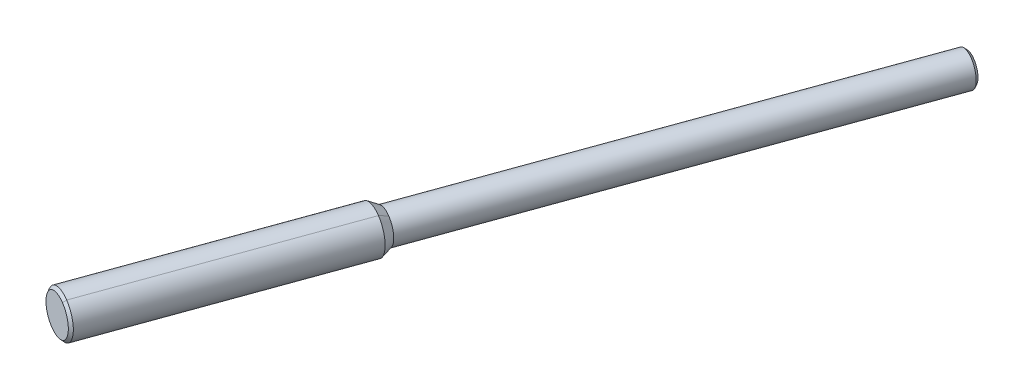
ISO-10303-21;
HEADER;
FILE_DESCRIPTION(('STEP AP214'),'2;1');
FILE_NAME('part.step','',(''),(''),'','','');
FILE_SCHEMA(('AUTOMOTIVE_DESIGN { 1 0 10303 214 1 1 1 1 }'));
ENDSEC;
DATA;
#1=APPLICATION_CONTEXT('core data for automotive mechanical design processes');
#2=APPLICATION_PROTOCOL_DEFINITION('international standard','automotive_design',2000,#1);
#3=PRODUCT_CONTEXT('',#1,'mechanical');
#4=PRODUCT('Part','Part','',(#3));
#5=PRODUCT_RELATED_PRODUCT_CATEGORY('part','',(#4));
#6=PRODUCT_DEFINITION_FORMATION('','',#4);
#7=PRODUCT_DEFINITION_CONTEXT('part definition',#1,'design');
#8=PRODUCT_DEFINITION('design','',#6,#7);
#9=PRODUCT_DEFINITION_SHAPE('','',#8);
#10=(LENGTH_UNIT() NAMED_UNIT(*) SI_UNIT(.MILLI.,.METRE.));
#11=(NAMED_UNIT(*) PLANE_ANGLE_UNIT() SI_UNIT($,.RADIAN.));
#12=(NAMED_UNIT(*) SI_UNIT($,.STERADIAN.) SOLID_ANGLE_UNIT());
#13=UNCERTAINTY_MEASURE_WITH_UNIT(LENGTH_MEASURE(1.E-05),#10,'distance_accuracy_value','');
#14=(GEOMETRIC_REPRESENTATION_CONTEXT(3) GLOBAL_UNCERTAINTY_ASSIGNED_CONTEXT((#13)) GLOBAL_UNIT_ASSIGNED_CONTEXT((#10,
#11,#12)) REPRESENTATION_CONTEXT('',''));
#15=CARTESIAN_POINT('',(0.,0.,0.));
#16=DIRECTION('',(0.,0.,1.));
#17=DIRECTION('',(1.,0.,0.));
#18=AXIS2_PLACEMENT_3D('',#15,#16,#17);
#19=CARTESIAN_POINT('',(235.856247632616,96.4726494375247,-182.327791961104));
#20=DIRECTION('',(0.340654989152249,0.000648546411340683,-0.940188150187628));
#21=DIRECTION('',(0.940188366977143,-0.000113870693776996,0.340654989152249));
#22=AXIS2_PLACEMENT_3D('',#19,#20,#21);
#23=CYLINDRICAL_SURFACE('',#22,4.);
#24=CARTESIAN_POINT('',(231.008028519139,96.4634192920475,-168.946986438929));
#25=DIRECTION('',(0.340654989152249,0.000648546411340683,-0.940188150187628));
#26=DIRECTION('',(-0.940188366977143,0.000113870693776996,-0.340654989152249));
#27=AXIS2_PLACEMENT_3D('',#24,#25,#26);
#28=CIRCLE('',#27,4.);
#29=CARTESIAN_POINT('',(232.81063005231,99.9735304085299,-168.291435020234));
#30=VERTEX_POINT('',#29);
#31=CARTESIAN_POINT('',(229.205426985966,92.953308175565,-169.602537857625));
#32=VERTEX_POINT('',#31);
#33=EDGE_CURVE('E82',#30,#32,#28,.T.);
#34=ORIENTED_EDGE('',*,*,#33,.F.);
#35=DIRECTION('',(0.340654989152249,0.000648546411340683,-0.940188150187628));
#36=VECTOR('',#35,1.);
#37=CARTESIAN_POINT('',(225.015089934413,99.9586890889282,-146.776193275504));
#38=LINE('',#37,#36);
#39=CARTESIAN_POINT('',(217.219549816653,99.9438477693267,-125.26095153115));
#40=VERTEX_POINT('',#39);
#41=EDGE_CURVE('E89',#40,#30,#38,.T.);
#42=ORIENTED_EDGE('',*,*,#41,.F.);
#43=CARTESIAN_POINT('',(215.416948283481,96.4337366528443,-125.916502949846));
#44=DIRECTION('',(0.340654989152249,0.000648546411340683,-0.940188150187628));
#45=DIRECTION('',(-0.940188366977143,0.000113870693776996,-0.340654989152249));
#46=AXIS2_PLACEMENT_3D('',#43,#44,#45);
#47=CIRCLE('',#46,4.);
#48=CARTESIAN_POINT('',(213.614346750309,92.9236255363619,-126.572054368542));
#49=VERTEX_POINT('',#48);
#50=EDGE_CURVE('E11',#40,#49,#47,.T.);
#51=ORIENTED_EDGE('',*,*,#50,.T.);
#52=DIRECTION('',(0.340654989152249,0.000648546411340683,-0.940188150187628));
#53=VECTOR('',#52,1.);
#54=CARTESIAN_POINT('',(221.409886868069,92.9384668559633,-148.087296112895));
#55=LINE('',#54,#53);
#56=EDGE_CURVE('E27',#49,#32,#55,.T.);
#57=ORIENTED_EDGE('',*,*,#56,.T.);
#58=EDGE_LOOP('',(#34,#42,#51,#57));
#59=FACE_BOUND('',#58,.T.);
#60=ADVANCED_FACE('F17',(#59),#23,.T.);
#61=CARTESIAN_POINT('',(235.856247632616,96.4726494375247,-182.327791961104));
#62=DIRECTION('',(0.340654989152249,0.000648546411340683,-0.940188150187628));
#63=DIRECTION('',(0.940188366977143,-0.000113870693776996,0.340654989152249));
#64=AXIS2_PLACEMENT_3D('',#61,#62,#63);
#65=CYLINDRICAL_SURFACE('',#64,4.);
#66=CARTESIAN_POINT('',(231.008028519139,96.4634192920475,-168.946986438929));
#67=DIRECTION('',(0.340654989152249,0.000648546411340683,-0.940188150187628));
#68=DIRECTION('',(-0.940188366977143,0.000113870693776996,-0.340654989152249));
#69=AXIS2_PLACEMENT_3D('',#66,#67,#68);
#70=CIRCLE('',#69,4.);
#71=EDGE_CURVE('E36',#32,#30,#70,.T.);
#72=ORIENTED_EDGE('',*,*,#71,.F.);
#73=ORIENTED_EDGE('',*,*,#56,.F.);
#74=CARTESIAN_POINT('',(215.416948283481,96.4337366528443,-125.916502949846));
#75=DIRECTION('',(0.340654989152249,0.000648546411340683,-0.940188150187628));
#76=DIRECTION('',(-0.940188366977143,0.000113870693776996,-0.340654989152249));
#77=AXIS2_PLACEMENT_3D('',#74,#75,#76);
#78=CIRCLE('',#77,4.);
#79=EDGE_CURVE('E91',#49,#40,#78,.T.);
#80=ORIENTED_EDGE('',*,*,#79,.T.);
#81=ORIENTED_EDGE('',*,*,#41,.T.);
#82=EDGE_LOOP('',(#72,#73,#80,#81));
#83=FACE_BOUND('',#82,.T.);
#84=ADVANCED_FACE('F131',(#83),#65,.T.);
#85=CARTESIAN_POINT('',(215.246620788904,96.4334123796386,-125.446408874752));
#86=DIRECTION('',(0.340654989152249,0.000648546411340683,-0.940188150187628));
#87=DIRECTION('',(0.450650383292255,0.877527779120979,0.163887854673695));
#88=AXIS2_PLACEMENT_3D('',#85,#86,#87);
#89=CONICAL_SURFACE('',#88,3.5,0.785398163396999);
#90=ORIENTED_EDGE('',*,*,#50,.F.);
#91=DIRECTION('',(0.559537394844707,0.620964434861356,-0.54892720319521));
#92=VECTOR('',#91,1.);
#93=CARTESIAN_POINT('',(217.021723473543,99.7243036879462,-125.066876457271));
#94=LINE('',#93,#92);
#95=CARTESIAN_POINT('',(216.823897130423,99.5047596065658,-124.872801383395));
#96=VERTEX_POINT('',#95);
#97=EDGE_CURVE('E97',#96,#40,#94,.T.);
#98=ORIENTED_EDGE('',*,*,#97,.F.);
#99=CARTESIAN_POINT('',(215.246620788904,96.4334123796386,-125.446408874752));
#100=DIRECTION('',(0.340654989152249,0.000648546411340683,-0.940188150187628));
#101=DIRECTION('',(-0.940188366977143,0.000113870693778979,-0.340654989152249));
#102=AXIS2_PLACEMENT_3D('',#99,#100,#101);
#103=CIRCLE('',#102,3.5);
#104=CARTESIAN_POINT('',(213.669344447386,93.3620651527115,-126.020016366108));
#105=VERTEX_POINT('',#104);
#106=EDGE_CURVE('E92',#96,#105,#103,.T.);
#107=ORIENTED_EDGE('',*,*,#106,.T.);
#108=DIRECTION('',(-0.0777784890954522,-0.62004725173061,-0.780699629982842));
#109=VECTOR('',#108,1.);
#110=CARTESIAN_POINT('',(213.641845598843,93.1428453445367,-126.296035367327));
#111=LINE('',#110,#109);
#112=EDGE_CURVE('E104',#105,#49,#111,.T.);
#113=ORIENTED_EDGE('',*,*,#112,.T.);
#114=EDGE_LOOP('',(#90,#98,#107,#113));
#115=FACE_BOUND('',#114,.T.);
#116=ADVANCED_FACE('F137',(#115),#89,.T.);
#117=CARTESIAN_POINT('',(215.246620788904,96.4334123796386,-125.446408874752));
#118=DIRECTION('',(0.340654989152249,0.000648546411340683,-0.940188150187628));
#119=DIRECTION('',(0.450650383292255,0.877527779120979,0.163887854673695));
#120=AXIS2_PLACEMENT_3D('',#117,#118,#119);
#121=CONICAL_SURFACE('',#120,3.5,0.785398163396999);
#122=ORIENTED_EDGE('',*,*,#79,.F.);
#123=ORIENTED_EDGE('',*,*,#112,.F.);
#124=CARTESIAN_POINT('',(215.246620788904,96.4334123796386,-125.446408874752));
#125=DIRECTION('',(0.340654989152249,0.000648546411340683,-0.940188150187628));
#126=DIRECTION('',(-0.940188366977143,0.000113870693778979,-0.340654989152249));
#127=AXIS2_PLACEMENT_3D('',#124,#125,#126);
#128=CIRCLE('',#127,3.5);
#129=EDGE_CURVE('E100',#105,#96,#128,.T.);
#130=ORIENTED_EDGE('',*,*,#129,.T.);
#131=ORIENTED_EDGE('',*,*,#97,.T.);
#132=EDGE_LOOP('',(#122,#123,#130,#131));
#133=FACE_BOUND('',#132,.T.);
#134=ADVANCED_FACE('F127',(#133),#121,.T.);
#135=CARTESIAN_POINT('',(235.856247632616,96.4726494375247,-182.327791961104));
#136=DIRECTION('',(0.340654989152249,0.000648546411340683,-0.940188150187628));
#137=DIRECTION('',(0.940188366977143,-0.000113870693776997,0.340654989152249));
#138=AXIS2_PLACEMENT_3D('',#135,#136,#137);
#139=CYLINDRICAL_SURFACE('',#138,3.);
#140=CARTESIAN_POINT('',(260.72406184073,96.5199933255526,-250.9615269248));
#141=DIRECTION('',(-0.340654989152249,-0.000648546411340683,0.940188150187628));
#142=DIRECTION('',(-0.940188366977143,0.000113870693776991,-0.340654989152249));
#143=AXIS2_PLACEMENT_3D('',#140,#141,#142);
#144=CIRCLE('',#143,3.);
#145=CARTESIAN_POINT('',(257.903496739799,96.5203349376339,-251.983491892257));
#146=VERTEX_POINT('',#145);
#147=EDGE_CURVE('E101',#146,#146,#144,.T.);
#148=ORIENTED_EDGE('',*,*,#147,.T.);
#149=EDGE_LOOP('',(#148));
#150=FACE_BOUND('',#149,.T.);
#151=DIRECTION('',(-0.340654989152249,-0.000648546411340683,0.940188150187628));
#152=VECTOR('',#151,1.);
#153=CARTESIAN_POINT('',(245.298754774856,99.1206357521559,-204.165596964039));
#154=LINE('',#153,#152);
#155=CARTESIAN_POINT('',(257.136515647897,99.14317273995,-236.83713518306));
#156=VERTEX_POINT('',#155);
#157=CARTESIAN_POINT('',(232.950011418087,99.0971259447448,-170.083776519738));
#158=VERTEX_POINT('',#157);
#159=EDGE_CURVE('E111',#156,#158,#154,.T.);
#160=ORIENTED_EDGE('',*,*,#159,.F.);
#161=ORIENTED_EDGE('',*,*,#159,.T.);
#162=CARTESIAN_POINT('',(231.598060268212,96.464542607383,-170.575440083758));
#163=DIRECTION('',(0.340654989152249,0.000648546411340683,-0.940188150187628));
#164=DIRECTION('',(-0.940188366977143,0.000113870693776997,-0.340654989152249));
#165=AXIS2_PLACEMENT_3D('',#162,#163,#164);
#166=CIRCLE('',#165,3.);
#167=CARTESIAN_POINT('',(230.246109118339,93.8319592700212,-171.067103647778));
#168=VERTEX_POINT('',#167);
#169=EDGE_CURVE('E114',#158,#168,#166,.T.);
#170=ORIENTED_EDGE('',*,*,#169,.T.);
#171=DIRECTION('',(-0.340654989152249,-0.000648546411340683,0.940188150187628));
#172=VECTOR('',#171,1.);
#173=CARTESIAN_POINT('',(242.594852475108,93.8554690774323,-205.14892409208));
#174=LINE('',#173,#172);
#175=CARTESIAN_POINT('',(254.432613348148,93.8780060652264,-237.8204623111));
#176=VERTEX_POINT('',#175);
#177=EDGE_CURVE('E68',#176,#168,#174,.T.);
#178=ORIENTED_EDGE('',*,*,#177,.F.);
#179=ORIENTED_EDGE('',*,*,#177,.T.);
#180=CARTESIAN_POINT('',(231.598060268212,96.464542607383,-170.575440083758));
#181=DIRECTION('',(0.340654989152249,0.000648546411340683,-0.940188150187628));
#182=DIRECTION('',(-0.940188366977143,0.000113870693776997,-0.340654989152249));
#183=AXIS2_PLACEMENT_3D('',#180,#181,#182);
#184=CIRCLE('',#183,3.);
#185=EDGE_CURVE('E79',#168,#158,#184,.T.);
#186=ORIENTED_EDGE('',*,*,#185,.T.);
#187=EDGE_LOOP('',(#160,#161,#170,#178,#179,#186));
#188=FACE_BOUND('',#187,.T.);
#189=ADVANCED_FACE('F115',(#150,#188),#139,.T.);
#190=CARTESIAN_POINT('',(231.598060268212,96.464542607383,-170.575440083758));
#191=DIRECTION('',(-0.340654989152249,-0.000648546411340683,0.940188150187628));
#192=DIRECTION('',(0.450650383292255,0.877527779120979,0.163887854673695));
#193=AXIS2_PLACEMENT_3D('',#190,#191,#192);
#194=CONICAL_SURFACE('',#193,3.,0.523598775598001);
#195=ORIENTED_EDGE('',*,*,#169,.F.);
#196=DIRECTION('',(0.0696906828856126,-0.438202231892762,-0.896170749736421));
#197=VECTOR('',#196,1.);
#198=CARTESIAN_POINT('',(232.880320735194,99.5353281766423,-169.187605769987));
#199=LINE('',#198,#197);
#200=EDGE_CURVE('E73',#30,#158,#199,.T.);
#201=ORIENTED_EDGE('',*,*,#200,.F.);
#202=ORIENTED_EDGE('',*,*,#33,.T.);
#203=DIRECTION('',(0.520341066177894,0.439325547228271,-0.732282895062716));
#204=VECTOR('',#203,1.);
#205=CARTESIAN_POINT('',(229.725768052157,93.3926337227881,-170.3348207527));
#206=LINE('',#205,#204);
#207=EDGE_CURVE('E76',#32,#168,#206,.T.);
#208=ORIENTED_EDGE('',*,*,#207,.T.);
#209=EDGE_LOOP('',(#195,#201,#202,#208));
#210=FACE_BOUND('',#209,.T.);
#211=ADVANCED_FACE('F116',(#210),#194,.T.);
#212=CARTESIAN_POINT('',(231.598060268212,96.464542607383,-170.575440083758));
#213=DIRECTION('',(-0.340654989152249,-0.000648546411340683,0.940188150187628));
#214=DIRECTION('',(0.450650383292255,0.877527779120979,0.163887854673695));
#215=AXIS2_PLACEMENT_3D('',#212,#213,#214);
#216=CONICAL_SURFACE('',#215,3.,0.523598775598001);
#217=ORIENTED_EDGE('',*,*,#185,.F.);
#218=ORIENTED_EDGE('',*,*,#207,.F.);
#219=ORIENTED_EDGE('',*,*,#71,.T.);
#220=ORIENTED_EDGE('',*,*,#200,.T.);
#221=EDGE_LOOP('',(#217,#218,#219,#220));
#222=FACE_BOUND('',#221,.T.);
#223=ADVANCED_FACE('F118',(#222),#216,.T.);
#224=CARTESIAN_POINT('',(215.246620788904,96.4334123796386,-125.446408874752));
#225=DIRECTION('',(0.340654989152249,0.000648546411340683,-0.940188150187628));
#226=DIRECTION('',(0.940188366977143,-0.000113870693777079,0.340654989152249));
#227=AXIS2_PLACEMENT_3D('',#224,#225,#226);
#228=PLANE('',#227);
#229=ORIENTED_EDGE('',*,*,#106,.F.);
#230=ORIENTED_EDGE('',*,*,#129,.F.);
#231=EDGE_LOOP('',(#229,#230));
#232=FACE_BOUND('',#231,.T.);
#233=ADVANCED_FACE('F125',(#232),#228,.F.);
#234=CARTESIAN_POINT('',(260.894389335306,96.5203175987583,-251.431620999894));
#235=DIRECTION('',(0.340654989152249,0.000648546411340683,-0.940188150187628));
#236=DIRECTION('',(0.940188366977143,-0.00011387069377708,0.340654989152249));
#237=AXIS2_PLACEMENT_3D('',#234,#235,#236);
#238=PLANE('',#237);
#239=CARTESIAN_POINT('',(260.894389335306,96.5203175987583,-251.431620999894));
#240=DIRECTION('',(0.340654989152249,0.000648546411340683,-0.940188150187628));
#241=DIRECTION('',(-0.940188366977143,0.000113870693779767,-0.340654989152249));
#242=AXIS2_PLACEMENT_3D('',#239,#240,#241);
#243=CIRCLE('',#242,2.5);
#244=CARTESIAN_POINT('',(258.543918417863,96.5206022754927,-252.283258472775));
#245=VERTEX_POINT('',#244);
#246=EDGE_CURVE('E21',#245,#245,#243,.T.);
#247=ORIENTED_EDGE('',*,*,#246,.T.);
#248=EDGE_LOOP('',(#247));
#249=FACE_BOUND('',#248,.T.);
#250=ADVANCED_FACE('F154',(#249),#238,.T.);
#251=CARTESIAN_POINT('',(260.894389335306,96.5203175987583,-251.431620999894));
#252=DIRECTION('',(-0.340654989152249,-0.000648546411340683,0.940188150187628));
#253=DIRECTION('',(-0.940188366977143,0.000113870693777086,-0.340654989152249));
#254=AXIS2_PLACEMENT_3D('',#251,#252,#253);
#255=CONICAL_SURFACE('',#254,2.5,0.785398163397448);
#256=ORIENTED_EDGE('',*,*,#147,.F.);
#257=EDGE_LOOP('',(#256));
#258=FACE_BOUND('',#257,.T.);
#259=ORIENTED_EDGE('',*,*,#246,.F.);
#260=EDGE_LOOP('',(#259));
#261=FACE_BOUND('',#260,.T.);
#262=ADVANCED_FACE('F19',(#258,#261),#255,.T.);
#263=CLOSED_SHELL('',(#60,#84,#116,#134,#189,#211,#223,#233,#250,#262));
#264=MANIFOLD_SOLID_BREP('B1',#263);
#265=ADVANCED_BREP_SHAPE_REPRESENTATION('',(#18,#264),#14);
#266=SHAPE_DEFINITION_REPRESENTATION(#9,#265);
ENDSEC;
END-ISO-10303-21;
